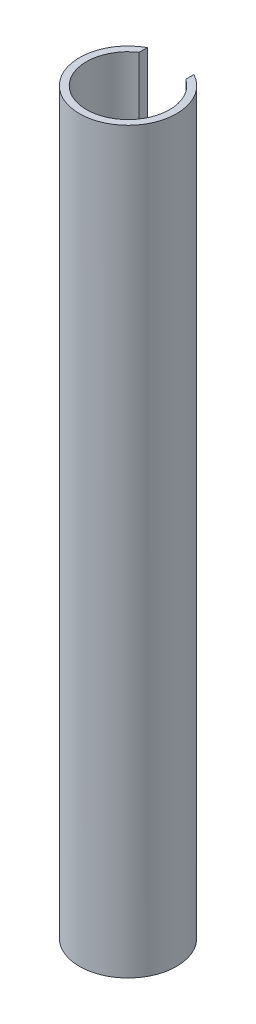
ISO-10303-21;
HEADER;
FILE_DESCRIPTION(('STEP AP214'),'2;1');
FILE_NAME('part.step','',(''),(''),'','','');
FILE_SCHEMA(('AUTOMOTIVE_DESIGN { 1 0 10303 214 1 1 1 1 }'));
ENDSEC;
DATA;
#1=APPLICATION_CONTEXT('core data for automotive mechanical design processes');
#2=APPLICATION_PROTOCOL_DEFINITION('international standard','automotive_design',2000,#1);
#3=PRODUCT_CONTEXT('',#1,'mechanical');
#4=PRODUCT('Part','Part','',(#3));
#5=PRODUCT_RELATED_PRODUCT_CATEGORY('part','',(#4));
#6=PRODUCT_DEFINITION_FORMATION('','',#4);
#7=PRODUCT_DEFINITION_CONTEXT('part definition',#1,'design');
#8=PRODUCT_DEFINITION('design','',#6,#7);
#9=PRODUCT_DEFINITION_SHAPE('','',#8);
#10=(LENGTH_UNIT() NAMED_UNIT(*) SI_UNIT(.MILLI.,.METRE.));
#11=(NAMED_UNIT(*) PLANE_ANGLE_UNIT() SI_UNIT($,.RADIAN.));
#12=(NAMED_UNIT(*) SI_UNIT($,.STERADIAN.) SOLID_ANGLE_UNIT());
#13=UNCERTAINTY_MEASURE_WITH_UNIT(LENGTH_MEASURE(1.E-05),#10,'distance_accuracy_value','');
#14=(GEOMETRIC_REPRESENTATION_CONTEXT(3) GLOBAL_UNCERTAINTY_ASSIGNED_CONTEXT((#13)) GLOBAL_UNIT_ASSIGNED_CONTEXT((#10,
#11,#12)) REPRESENTATION_CONTEXT('',''));
#15=CARTESIAN_POINT('',(0.,0.,0.));
#16=DIRECTION('',(0.,0.,1.));
#17=DIRECTION('',(1.,0.,0.));
#18=AXIS2_PLACEMENT_3D('',#15,#16,#17);
#19=CARTESIAN_POINT('',(0.,190.,0.));
#20=DIRECTION('',(0.,1.,0.));
#21=DIRECTION('',(0.,0.,1.));
#22=AXIS2_PLACEMENT_3D('',#19,#20,#21);
#23=PLANE('',#22);
#24=DIRECTION('',(0.,0.,1.));
#25=VECTOR('',#24,1.);
#26=CARTESIAN_POINT('',(-6.,190.,-12.8143938205598));
#27=LINE('',#26,#25);
#28=CARTESIAN_POINT('',(-6.,190.,-10.9658560997307));
#29=VERTEX_POINT('',#28);
#30=CARTESIAN_POINT('',(-6.,190.,-8.85945822271317));
#31=VERTEX_POINT('',#30);
#32=EDGE_CURVE('E94',#29,#31,#27,.T.);
#33=ORIENTED_EDGE('',*,*,#32,.F.);
#34=CARTESIAN_POINT('',(0.,190.,0.));
#35=DIRECTION('',(0.,1.,0.));
#36=DIRECTION('',(0.,0.,1.));
#37=AXIS2_PLACEMENT_3D('',#34,#35,#36);
#38=CIRCLE('',#37,12.5);
#39=CARTESIAN_POINT('',(6.,190.,-10.9658560997307));
#40=VERTEX_POINT('',#39);
#41=EDGE_CURVE('E105',#29,#40,#38,.T.);
#42=ORIENTED_EDGE('',*,*,#41,.T.);
#43=DIRECTION('',(0.,0.,-1.));
#44=VECTOR('',#43,1.);
#45=CARTESIAN_POINT('',(6.,190.,-12.8143938205598));
#46=LINE('',#45,#44);
#47=CARTESIAN_POINT('',(6.,190.,-8.85945822271317));
#48=VERTEX_POINT('',#47);
#49=EDGE_CURVE('E108',#48,#40,#46,.T.);
#50=ORIENTED_EDGE('',*,*,#49,.F.);
#51=CARTESIAN_POINT('',(0.,190.,0.));
#52=DIRECTION('',(0.,1.,0.));
#53=DIRECTION('',(0.,0.,1.));
#54=AXIS2_PLACEMENT_3D('',#51,#52,#53);
#55=CIRCLE('',#54,10.7);
#56=EDGE_CURVE('E107',#31,#48,#55,.T.);
#57=ORIENTED_EDGE('',*,*,#56,.F.);
#58=EDGE_LOOP('',(#33,#42,#50,#57));
#59=FACE_BOUND('',#58,.T.);
#60=ADVANCED_FACE('F51',(#59),#23,.T.);
#61=CARTESIAN_POINT('',(0.,0.,0.));
#62=DIRECTION('',(0.,1.,0.));
#63=DIRECTION('',(0.,0.,1.));
#64=AXIS2_PLACEMENT_3D('',#61,#62,#63);
#65=PLANE('',#64);
#66=CARTESIAN_POINT('',(0.,0.,0.));
#67=DIRECTION('',(0.,1.,0.));
#68=DIRECTION('',(0.,0.,1.));
#69=AXIS2_PLACEMENT_3D('',#66,#67,#68);
#70=CIRCLE('',#69,12.5);
#71=CARTESIAN_POINT('',(0.,0.,12.5));
#72=VERTEX_POINT('',#71);
#73=EDGE_CURVE('E113',#72,#72,#70,.T.);
#74=ORIENTED_EDGE('',*,*,#73,.F.);
#75=EDGE_LOOP('',(#74));
#76=FACE_BOUND('',#75,.T.);
#77=CARTESIAN_POINT('',(0.,0.,0.));
#78=DIRECTION('',(0.,1.,0.));
#79=DIRECTION('',(0.,0.,1.));
#80=AXIS2_PLACEMENT_3D('',#77,#78,#79);
#81=CIRCLE('',#80,10.7);
#82=CARTESIAN_POINT('',(0.,0.,10.7));
#83=VERTEX_POINT('',#82);
#84=EDGE_CURVE('E99',#83,#83,#81,.T.);
#85=ORIENTED_EDGE('',*,*,#84,.T.);
#86=EDGE_LOOP('',(#85));
#87=FACE_BOUND('',#86,.T.);
#88=ADVANCED_FACE('F148',(#76,#87),#65,.F.);
#89=CARTESIAN_POINT('',(0.,190.,0.));
#90=DIRECTION('',(0.,-1.,0.));
#91=DIRECTION('',(0.,0.,-1.));
#92=AXIS2_PLACEMENT_3D('',#89,#90,#91);
#93=CYLINDRICAL_SURFACE('',#92,12.5);
#94=ORIENTED_EDGE('',*,*,#41,.F.);
#95=DIRECTION('',(0.,-1.,0.));
#96=VECTOR('',#95,1.);
#97=CARTESIAN_POINT('',(-6.,190.,-10.9658560997307));
#98=LINE('',#97,#96);
#99=CARTESIAN_POINT('',(-6.,140.,-10.9658560997307));
#100=VERTEX_POINT('',#99);
#101=EDGE_CURVE('E91',#29,#100,#98,.T.);
#102=ORIENTED_EDGE('',*,*,#101,.T.);
#103=CARTESIAN_POINT('',(0.,140.,0.));
#104=DIRECTION('',(0.,1.,0.));
#105=DIRECTION('',(0.,0.,1.));
#106=AXIS2_PLACEMENT_3D('',#103,#104,#105);
#107=CIRCLE('',#106,12.5);
#108=CARTESIAN_POINT('',(6.,140.,-10.9658560997307));
#109=VERTEX_POINT('',#108);
#110=EDGE_CURVE('E137',#109,#100,#107,.T.);
#111=ORIENTED_EDGE('',*,*,#110,.F.);
#112=DIRECTION('',(0.,-1.,0.));
#113=VECTOR('',#112,1.);
#114=CARTESIAN_POINT('',(6.,190.,-10.9658560997307));
#115=LINE('',#114,#113);
#116=EDGE_CURVE('E73',#109,#40,#115,.F.);
#117=ORIENTED_EDGE('',*,*,#116,.T.);
#118=EDGE_LOOP('',(#94,#102,#111,#117));
#119=FACE_BOUND('',#118,.T.);
#120=ORIENTED_EDGE('',*,*,#73,.T.);
#121=EDGE_LOOP('',(#120));
#122=FACE_BOUND('',#121,.T.);
#123=ADVANCED_FACE('F53',(#119,#122),#93,.T.);
#124=CARTESIAN_POINT('',(0.,190.,0.));
#125=DIRECTION('',(0.,-1.,0.));
#126=DIRECTION('',(0.,0.,-1.));
#127=AXIS2_PLACEMENT_3D('',#124,#125,#126);
#128=CYLINDRICAL_SURFACE('',#127,10.7);
#129=DIRECTION('',(0.,-1.,0.));
#130=VECTOR('',#129,1.);
#131=CARTESIAN_POINT('',(-6.,190.,-8.85945822271317));
#132=LINE('',#131,#130);
#133=CARTESIAN_POINT('',(-6.,140.,-8.85945822271317));
#134=VERTEX_POINT('',#133);
#135=EDGE_CURVE('E13',#31,#134,#132,.T.);
#136=ORIENTED_EDGE('',*,*,#135,.F.);
#137=ORIENTED_EDGE('',*,*,#56,.T.);
#138=DIRECTION('',(0.,-1.,0.));
#139=VECTOR('',#138,1.);
#140=CARTESIAN_POINT('',(6.,190.,-8.85945822271317));
#141=LINE('',#140,#139);
#142=CARTESIAN_POINT('',(6.,140.,-8.85945822271317));
#143=VERTEX_POINT('',#142);
#144=EDGE_CURVE('E59',#143,#48,#141,.F.);
#145=ORIENTED_EDGE('',*,*,#144,.F.);
#146=CARTESIAN_POINT('',(0.,140.,0.));
#147=DIRECTION('',(0.,1.,0.));
#148=DIRECTION('',(0.,0.,1.));
#149=AXIS2_PLACEMENT_3D('',#146,#147,#148);
#150=CIRCLE('',#149,10.7);
#151=EDGE_CURVE('E112',#143,#134,#150,.T.);
#152=ORIENTED_EDGE('',*,*,#151,.T.);
#153=EDGE_LOOP('',(#136,#137,#145,#152));
#154=FACE_BOUND('',#153,.T.);
#155=ORIENTED_EDGE('',*,*,#84,.F.);
#156=EDGE_LOOP('',(#155));
#157=FACE_BOUND('',#156,.T.);
#158=ADVANCED_FACE('F129',(#154,#157),#128,.F.);
#159=CARTESIAN_POINT('',(-6.,140.,-12.8143938205598));
#160=DIRECTION('',(-1.,0.,0.));
#161=DIRECTION('',(0.,0.,1.));
#162=AXIS2_PLACEMENT_3D('',#159,#160,#161);
#163=PLANE('',#162);
#164=ORIENTED_EDGE('',*,*,#32,.T.);
#165=ORIENTED_EDGE('',*,*,#135,.T.);
#166=DIRECTION('',(0.,0.,1.));
#167=VECTOR('',#166,1.);
#168=CARTESIAN_POINT('',(-6.,140.,-12.8143938205598));
#169=LINE('',#168,#167);
#170=EDGE_CURVE('E66',#100,#134,#169,.T.);
#171=ORIENTED_EDGE('',*,*,#170,.F.);
#172=ORIENTED_EDGE('',*,*,#101,.F.);
#173=EDGE_LOOP('',(#164,#165,#171,#172));
#174=FACE_BOUND('',#173,.T.);
#175=ADVANCED_FACE('F93',(#174),#163,.F.);
#176=CARTESIAN_POINT('',(6.,140.,-12.8143938205598));
#177=DIRECTION('',(1.,0.,0.));
#178=DIRECTION('',(0.,0.,-1.));
#179=AXIS2_PLACEMENT_3D('',#176,#177,#178);
#180=PLANE('',#179);
#181=DIRECTION('',(0.,0.,-1.));
#182=VECTOR('',#181,1.);
#183=CARTESIAN_POINT('',(6.,140.,-12.8143938205598));
#184=LINE('',#183,#182);
#185=EDGE_CURVE('E126',#143,#109,#184,.T.);
#186=ORIENTED_EDGE('',*,*,#185,.F.);
#187=ORIENTED_EDGE('',*,*,#144,.T.);
#188=ORIENTED_EDGE('',*,*,#49,.T.);
#189=ORIENTED_EDGE('',*,*,#116,.F.);
#190=EDGE_LOOP('',(#186,#187,#188,#189));
#191=FACE_BOUND('',#190,.T.);
#192=ADVANCED_FACE('F125',(#191),#180,.F.);
#193=CARTESIAN_POINT('',(0.,140.,0.));
#194=DIRECTION('',(0.,1.,0.));
#195=DIRECTION('',(0.,0.,1.));
#196=AXIS2_PLACEMENT_3D('',#193,#194,#195);
#197=PLANE('',#196);
#198=ORIENTED_EDGE('',*,*,#110,.T.);
#199=ORIENTED_EDGE('',*,*,#170,.T.);
#200=ORIENTED_EDGE('',*,*,#151,.F.);
#201=ORIENTED_EDGE('',*,*,#185,.T.);
#202=EDGE_LOOP('',(#198,#199,#200,#201));
#203=FACE_BOUND('',#202,.T.);
#204=ADVANCED_FACE('F140',(#203),#197,.T.);
#205=CLOSED_SHELL('',(#60,#88,#123,#158,#175,#192,#204));
#206=MANIFOLD_SOLID_BREP('B2',#205);
#207=ADVANCED_BREP_SHAPE_REPRESENTATION('',(#18,#206),#14);
#208=SHAPE_DEFINITION_REPRESENTATION(#9,#207);
ENDSEC;
END-ISO-10303-21;
